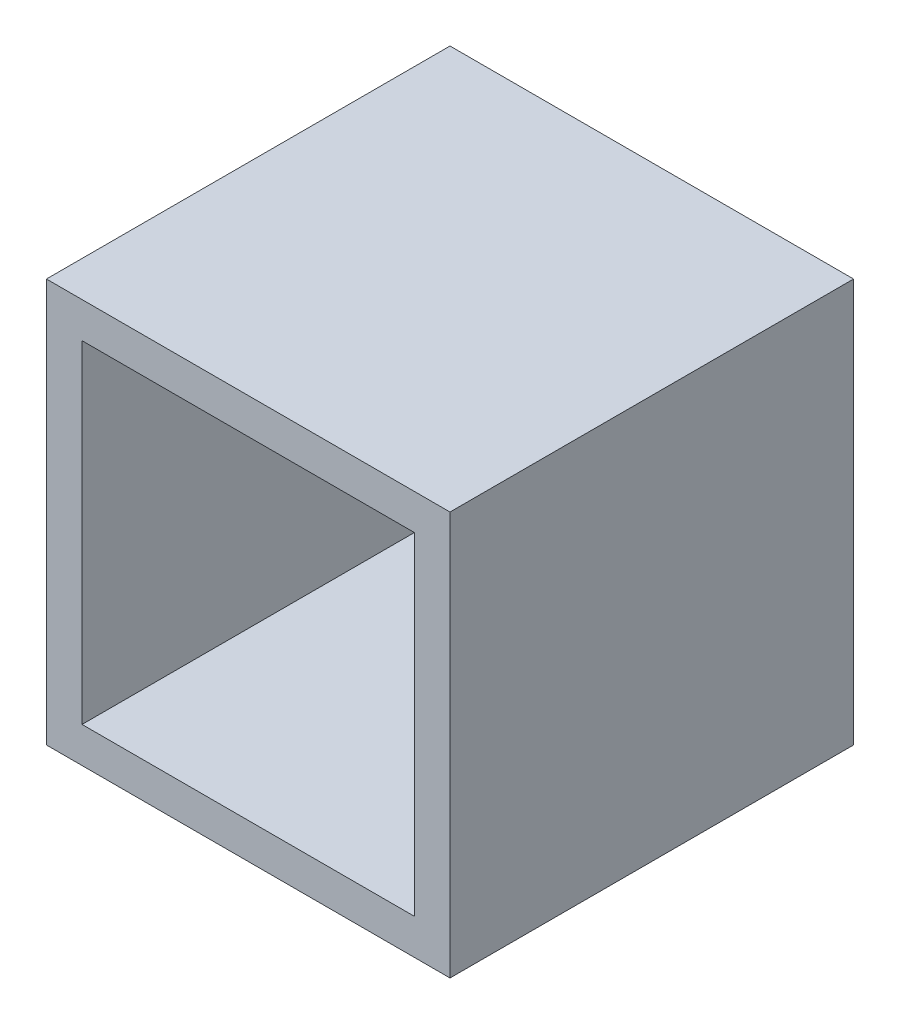
ISO-10303-21;
HEADER;
FILE_DESCRIPTION(('STEP AP214'),'2;1');
FILE_NAME('part.step','',(''),(''),'','','');
FILE_SCHEMA(('AUTOMOTIVE_DESIGN { 1 0 10303 214 1 1 1 1 }'));
ENDSEC;
DATA;
#1=APPLICATION_CONTEXT('core data for automotive mechanical design processes');
#2=APPLICATION_PROTOCOL_DEFINITION('international standard','automotive_design',2000,#1);
#3=PRODUCT_CONTEXT('',#1,'mechanical');
#4=PRODUCT('Part','Part','',(#3));
#5=PRODUCT_RELATED_PRODUCT_CATEGORY('part','',(#4));
#6=PRODUCT_DEFINITION_FORMATION('','',#4);
#7=PRODUCT_DEFINITION_CONTEXT('part definition',#1,'design');
#8=PRODUCT_DEFINITION('design','',#6,#7);
#9=PRODUCT_DEFINITION_SHAPE('','',#8);
#10=(LENGTH_UNIT() NAMED_UNIT(*) SI_UNIT(.MILLI.,.METRE.));
#11=(NAMED_UNIT(*) PLANE_ANGLE_UNIT() SI_UNIT($,.RADIAN.));
#12=(NAMED_UNIT(*) SI_UNIT($,.STERADIAN.) SOLID_ANGLE_UNIT());
#13=UNCERTAINTY_MEASURE_WITH_UNIT(LENGTH_MEASURE(1.E-05),#10,'distance_accuracy_value','');
#14=(GEOMETRIC_REPRESENTATION_CONTEXT(3) GLOBAL_UNCERTAINTY_ASSIGNED_CONTEXT((#13)) GLOBAL_UNIT_ASSIGNED_CONTEXT((#10,
#11,#12)) REPRESENTATION_CONTEXT('',''));
#15=CARTESIAN_POINT('',(0.,0.,0.));
#16=DIRECTION('',(0.,0.,1.));
#17=DIRECTION('',(1.,0.,0.));
#18=AXIS2_PLACEMENT_3D('',#15,#16,#17);
#19=CARTESIAN_POINT('',(-14.,-14.,34.));
#20=DIRECTION('',(1.,0.,0.));
#21=DIRECTION('',(0.,0.,-1.));
#22=AXIS2_PLACEMENT_3D('',#19,#20,#21);
#23=PLANE('',#22);
#24=DIRECTION('',(0.,0.,-1.));
#25=VECTOR('',#24,1.);
#26=CARTESIAN_POINT('',(-14.,-14.,34.));
#27=LINE('',#26,#25);
#28=CARTESIAN_POINT('',(-14.,-14.,34.));
#29=VERTEX_POINT('',#28);
#30=CARTESIAN_POINT('',(-14.,-14.,3.));
#31=VERTEX_POINT('',#30);
#32=EDGE_CURVE('E110',#29,#31,#27,.T.);
#33=ORIENTED_EDGE('',*,*,#32,.T.);
#34=DIRECTION('',(0.,-1.,0.));
#35=VECTOR('',#34,1.);
#36=CARTESIAN_POINT('',(-14.,14.,3.));
#37=LINE('',#36,#35);
#38=CARTESIAN_POINT('',(-14.,14.,3.));
#39=VERTEX_POINT('',#38);
#40=EDGE_CURVE('E99',#39,#31,#37,.T.);
#41=ORIENTED_EDGE('',*,*,#40,.F.);
#42=DIRECTION('',(0.,0.,-1.));
#43=VECTOR('',#42,1.);
#44=CARTESIAN_POINT('',(-14.,14.,34.));
#45=LINE('',#44,#43);
#46=CARTESIAN_POINT('',(-14.,14.,34.));
#47=VERTEX_POINT('',#46);
#48=EDGE_CURVE('E107',#47,#39,#45,.T.);
#49=ORIENTED_EDGE('',*,*,#48,.F.);
#50=DIRECTION('',(0.,-1.,0.));
#51=VECTOR('',#50,1.);
#52=CARTESIAN_POINT('',(-14.,-14.,34.));
#53=LINE('',#52,#51);
#54=EDGE_CURVE('E209',#47,#29,#53,.T.);
#55=ORIENTED_EDGE('',*,*,#54,.T.);
#56=EDGE_LOOP('',(#33,#41,#49,#55));
#57=FACE_BOUND('',#56,.T.);
#58=ADVANCED_FACE('F34',(#57),#23,.T.);
#59=CARTESIAN_POINT('',(14.,-14.,34.));
#60=DIRECTION('',(0.,1.,0.));
#61=DIRECTION('',(0.,0.,1.));
#62=AXIS2_PLACEMENT_3D('',#59,#60,#61);
#63=PLANE('',#62);
#64=DIRECTION('',(0.,0.,-1.));
#65=VECTOR('',#64,1.);
#66=CARTESIAN_POINT('',(14.,-14.,34.));
#67=LINE('',#66,#65);
#68=CARTESIAN_POINT('',(14.,-14.,34.));
#69=VERTEX_POINT('',#68);
#70=CARTESIAN_POINT('',(14.00000000001,-14.,3.));
#71=VERTEX_POINT('',#70);
#72=EDGE_CURVE('E116',#69,#71,#67,.T.);
#73=ORIENTED_EDGE('',*,*,#72,.T.);
#74=DIRECTION('',(-1.,0.,0.));
#75=VECTOR('',#74,1.);
#76=CARTESIAN_POINT('',(500000.,-14.,3.));
#77=LINE('',#76,#75);
#78=EDGE_CURVE('E102',#71,#31,#77,.T.);
#79=ORIENTED_EDGE('',*,*,#78,.T.);
#80=ORIENTED_EDGE('',*,*,#32,.F.);
#81=DIRECTION('',(1.,0.,0.));
#82=VECTOR('',#81,1.);
#83=CARTESIAN_POINT('',(14.,-14.,34.));
#84=LINE('',#83,#82);
#85=EDGE_CURVE('E208',#29,#69,#84,.T.);
#86=ORIENTED_EDGE('',*,*,#85,.T.);
#87=EDGE_LOOP('',(#73,#79,#80,#86));
#88=FACE_BOUND('',#87,.T.);
#89=ADVANCED_FACE('F178',(#88),#63,.T.);
#90=CARTESIAN_POINT('',(14.,-14.,34.));
#91=DIRECTION('',(-1.,0.,0.));
#92=DIRECTION('',(0.,0.,1.));
#93=AXIS2_PLACEMENT_3D('',#90,#91,#92);
#94=PLANE('',#93);
#95=DIRECTION('',(0.,0.,-1.));
#96=VECTOR('',#95,1.);
#97=CARTESIAN_POINT('',(14.,14.,34.));
#98=LINE('',#97,#96);
#99=CARTESIAN_POINT('',(14.,14.,34.));
#100=VERTEX_POINT('',#99);
#101=CARTESIAN_POINT('',(14.,14.,3.));
#102=VERTEX_POINT('',#101);
#103=EDGE_CURVE('E56',#100,#102,#98,.T.);
#104=ORIENTED_EDGE('',*,*,#103,.T.);
#105=DIRECTION('',(0.,1.,0.));
#106=VECTOR('',#105,1.);
#107=CARTESIAN_POINT('',(14.00000000001,14.,3.));
#108=LINE('',#107,#106);
#109=EDGE_CURVE('E49',#71,#102,#108,.T.);
#110=ORIENTED_EDGE('',*,*,#109,.F.);
#111=ORIENTED_EDGE('',*,*,#72,.F.);
#112=DIRECTION('',(0.,1.,0.));
#113=VECTOR('',#112,1.);
#114=CARTESIAN_POINT('',(14.,-14.,34.));
#115=LINE('',#114,#113);
#116=EDGE_CURVE('E118',#69,#100,#115,.T.);
#117=ORIENTED_EDGE('',*,*,#116,.T.);
#118=EDGE_LOOP('',(#104,#110,#111,#117));
#119=FACE_BOUND('',#118,.T.);
#120=ADVANCED_FACE('F183',(#119),#94,.T.);
#121=CARTESIAN_POINT('',(14.,14.,34.));
#122=DIRECTION('',(0.,-1.,0.));
#123=DIRECTION('',(0.,0.,-1.));
#124=AXIS2_PLACEMENT_3D('',#121,#122,#123);
#125=PLANE('',#124);
#126=ORIENTED_EDGE('',*,*,#48,.T.);
#127=DIRECTION('',(-1.,0.,0.));
#128=VECTOR('',#127,1.);
#129=CARTESIAN_POINT('',(500000.,14.,3.));
#130=LINE('',#129,#128);
#131=EDGE_CURVE('E96',#102,#39,#130,.T.);
#132=ORIENTED_EDGE('',*,*,#131,.F.);
#133=ORIENTED_EDGE('',*,*,#103,.F.);
#134=DIRECTION('',(-1.,0.,0.));
#135=VECTOR('',#134,1.);
#136=CARTESIAN_POINT('',(14.,14.,34.));
#137=LINE('',#136,#135);
#138=EDGE_CURVE('E114',#100,#47,#137,.T.);
#139=ORIENTED_EDGE('',*,*,#138,.T.);
#140=EDGE_LOOP('',(#126,#132,#133,#139));
#141=FACE_BOUND('',#140,.T.);
#142=ADVANCED_FACE('F112',(#141),#125,.T.);
#143=CARTESIAN_POINT('',(0.,0.,34.));
#144=DIRECTION('',(0.,0.,1.));
#145=DIRECTION('',(1.,0.,0.));
#146=AXIS2_PLACEMENT_3D('',#143,#144,#145);
#147=PLANE('',#146);
#148=DIRECTION('',(0.,-1.,0.));
#149=VECTOR('',#148,1.);
#150=CARTESIAN_POINT('',(-17.,-17.,34.));
#151=LINE('',#150,#149);
#152=CARTESIAN_POINT('',(-17.,17.,34.));
#153=VERTEX_POINT('',#152);
#154=CARTESIAN_POINT('',(-17.,-17.,34.));
#155=VERTEX_POINT('',#154);
#156=EDGE_CURVE('E126',#153,#155,#151,.T.);
#157=ORIENTED_EDGE('',*,*,#156,.T.);
#158=DIRECTION('',(1.,0.,0.));
#159=VECTOR('',#158,1.);
#160=CARTESIAN_POINT('',(17.,-17.,34.));
#161=LINE('',#160,#159);
#162=CARTESIAN_POINT('',(17.,-17.,34.));
#163=VERTEX_POINT('',#162);
#164=EDGE_CURVE('E129',#155,#163,#161,.T.);
#165=ORIENTED_EDGE('',*,*,#164,.T.);
#166=DIRECTION('',(0.,1.,0.));
#167=VECTOR('',#166,1.);
#168=CARTESIAN_POINT('',(17.,-17.,34.));
#169=LINE('',#168,#167);
#170=CARTESIAN_POINT('',(17.,17.,34.));
#171=VERTEX_POINT('',#170);
#172=EDGE_CURVE('E132',#163,#171,#169,.T.);
#173=ORIENTED_EDGE('',*,*,#172,.T.);
#174=DIRECTION('',(-1.,0.,0.));
#175=VECTOR('',#174,1.);
#176=CARTESIAN_POINT('',(17.,17.,34.));
#177=LINE('',#176,#175);
#178=EDGE_CURVE('E134',#171,#153,#177,.T.);
#179=ORIENTED_EDGE('',*,*,#178,.T.);
#180=EDGE_LOOP('',(#157,#165,#173,#179));
#181=FACE_BOUND('',#180,.T.);
#182=ORIENTED_EDGE('',*,*,#85,.F.);
#183=ORIENTED_EDGE('',*,*,#54,.F.);
#184=ORIENTED_EDGE('',*,*,#138,.F.);
#185=ORIENTED_EDGE('',*,*,#116,.F.);
#186=EDGE_LOOP('',(#182,#183,#184,#185));
#187=FACE_BOUND('',#186,.T.);
#188=ADVANCED_FACE('F168',(#181,#187),#147,.T.);
#189=CARTESIAN_POINT('',(0.,0.,0.));
#190=DIRECTION('',(0.,0.,1.));
#191=DIRECTION('',(1.,0.,0.));
#192=AXIS2_PLACEMENT_3D('',#189,#190,#191);
#193=PLANE('',#192);
#194=DIRECTION('',(0.,-1.,0.));
#195=VECTOR('',#194,1.);
#196=CARTESIAN_POINT('',(-17.,-17.,0.));
#197=LINE('',#196,#195);
#198=CARTESIAN_POINT('',(-17.,17.,0.));
#199=VERTEX_POINT('',#198);
#200=CARTESIAN_POINT('',(-17.,-17.,0.));
#201=VERTEX_POINT('',#200);
#202=EDGE_CURVE('E125',#199,#201,#197,.T.);
#203=ORIENTED_EDGE('',*,*,#202,.F.);
#204=DIRECTION('',(-1.,0.,0.));
#205=VECTOR('',#204,1.);
#206=CARTESIAN_POINT('',(17.,17.,0.));
#207=LINE('',#206,#205);
#208=CARTESIAN_POINT('',(17.,17.,0.));
#209=VERTEX_POINT('',#208);
#210=EDGE_CURVE('E130',#209,#199,#207,.T.);
#211=ORIENTED_EDGE('',*,*,#210,.F.);
#212=DIRECTION('',(0.,1.,0.));
#213=VECTOR('',#212,1.);
#214=CARTESIAN_POINT('',(17.,-17.,0.));
#215=LINE('',#214,#213);
#216=CARTESIAN_POINT('',(17.,-17.,0.));
#217=VERTEX_POINT('',#216);
#218=EDGE_CURVE('E141',#217,#209,#215,.T.);
#219=ORIENTED_EDGE('',*,*,#218,.F.);
#220=DIRECTION('',(1.,0.,0.));
#221=VECTOR('',#220,1.);
#222=CARTESIAN_POINT('',(17.,-17.,0.));
#223=LINE('',#222,#221);
#224=EDGE_CURVE('E139',#201,#217,#223,.T.);
#225=ORIENTED_EDGE('',*,*,#224,.F.);
#226=EDGE_LOOP('',(#203,#211,#219,#225));
#227=FACE_BOUND('',#226,.T.);
#228=ADVANCED_FACE('F159',(#227),#193,.F.);
#229=CARTESIAN_POINT('',(-17.,-17.,34.));
#230=DIRECTION('',(1.,0.,0.));
#231=DIRECTION('',(0.,0.,-1.));
#232=AXIS2_PLACEMENT_3D('',#229,#230,#231);
#233=PLANE('',#232);
#234=ORIENTED_EDGE('',*,*,#202,.T.);
#235=DIRECTION('',(0.,0.,-1.));
#236=VECTOR('',#235,1.);
#237=CARTESIAN_POINT('',(-17.,-17.,34.));
#238=LINE('',#237,#236);
#239=EDGE_CURVE('E11',#155,#201,#238,.T.);
#240=ORIENTED_EDGE('',*,*,#239,.F.);
#241=ORIENTED_EDGE('',*,*,#156,.F.);
#242=DIRECTION('',(0.,0.,-1.));
#243=VECTOR('',#242,1.);
#244=CARTESIAN_POINT('',(-17.,17.,34.));
#245=LINE('',#244,#243);
#246=EDGE_CURVE('E136',#153,#199,#245,.T.);
#247=ORIENTED_EDGE('',*,*,#246,.T.);
#248=EDGE_LOOP('',(#234,#240,#241,#247));
#249=FACE_BOUND('',#248,.T.);
#250=ADVANCED_FACE('F36',(#249),#233,.F.);
#251=CARTESIAN_POINT('',(17.,-17.,34.));
#252=DIRECTION('',(0.,1.,0.));
#253=DIRECTION('',(-1.,0.,0.));
#254=AXIS2_PLACEMENT_3D('',#251,#252,#253);
#255=PLANE('',#254);
#256=ORIENTED_EDGE('',*,*,#224,.T.);
#257=DIRECTION('',(0.,0.,-1.));
#258=VECTOR('',#257,1.);
#259=CARTESIAN_POINT('',(17.,-17.,34.));
#260=LINE('',#259,#258);
#261=EDGE_CURVE('E42',#163,#217,#260,.T.);
#262=ORIENTED_EDGE('',*,*,#261,.F.);
#263=ORIENTED_EDGE('',*,*,#164,.F.);
#264=ORIENTED_EDGE('',*,*,#239,.T.);
#265=EDGE_LOOP('',(#256,#262,#263,#264));
#266=FACE_BOUND('',#265,.T.);
#267=ADVANCED_FACE('F170',(#266),#255,.F.);
#268=CARTESIAN_POINT('',(17.,-17.,34.));
#269=DIRECTION('',(-1.,0.,0.));
#270=DIRECTION('',(0.,0.,1.));
#271=AXIS2_PLACEMENT_3D('',#268,#269,#270);
#272=PLANE('',#271);
#273=ORIENTED_EDGE('',*,*,#218,.T.);
#274=DIRECTION('',(0.,0.,-1.));
#275=VECTOR('',#274,1.);
#276=CARTESIAN_POINT('',(17.,17.,34.));
#277=LINE('',#276,#275);
#278=EDGE_CURVE('E146',#171,#209,#277,.T.);
#279=ORIENTED_EDGE('',*,*,#278,.F.);
#280=ORIENTED_EDGE('',*,*,#172,.F.);
#281=ORIENTED_EDGE('',*,*,#261,.T.);
#282=EDGE_LOOP('',(#273,#279,#280,#281));
#283=FACE_BOUND('',#282,.T.);
#284=ADVANCED_FACE('F153',(#283),#272,.F.);
#285=CARTESIAN_POINT('',(17.,17.,34.));
#286=DIRECTION('',(0.,-1.,0.));
#287=DIRECTION('',(0.,0.,-1.));
#288=AXIS2_PLACEMENT_3D('',#285,#286,#287);
#289=PLANE('',#288);
#290=ORIENTED_EDGE('',*,*,#210,.T.);
#291=ORIENTED_EDGE('',*,*,#246,.F.);
#292=ORIENTED_EDGE('',*,*,#178,.F.);
#293=ORIENTED_EDGE('',*,*,#278,.T.);
#294=EDGE_LOOP('',(#290,#291,#292,#293));
#295=FACE_BOUND('',#294,.T.);
#296=ADVANCED_FACE('F162',(#295),#289,.F.);
#297=CARTESIAN_POINT('',(500000.,14.,3.));
#298=DIRECTION('',(0.,0.,-1.));
#299=DIRECTION('',(0.,1.,0.));
#300=AXIS2_PLACEMENT_3D('',#297,#298,#299);
#301=PLANE('',#300);
#302=ORIENTED_EDGE('',*,*,#78,.F.);
#303=ORIENTED_EDGE('',*,*,#109,.T.);
#304=ORIENTED_EDGE('',*,*,#131,.T.);
#305=ORIENTED_EDGE('',*,*,#40,.T.);
#306=EDGE_LOOP('',(#302,#303,#304,#305));
#307=FACE_BOUND('',#306,.T.);
#308=ADVANCED_FACE('F98',(#307),#301,.F.);
#309=CLOSED_SHELL('',(#58,#89,#120,#142,#188,#228,#250,#267,#284,#296,#308));
#310=MANIFOLD_SOLID_BREP('B2',#309);
#311=ADVANCED_BREP_SHAPE_REPRESENTATION('',(#18,#310),#14);
#312=SHAPE_DEFINITION_REPRESENTATION(#9,#311);
ENDSEC;
END-ISO-10303-21;
